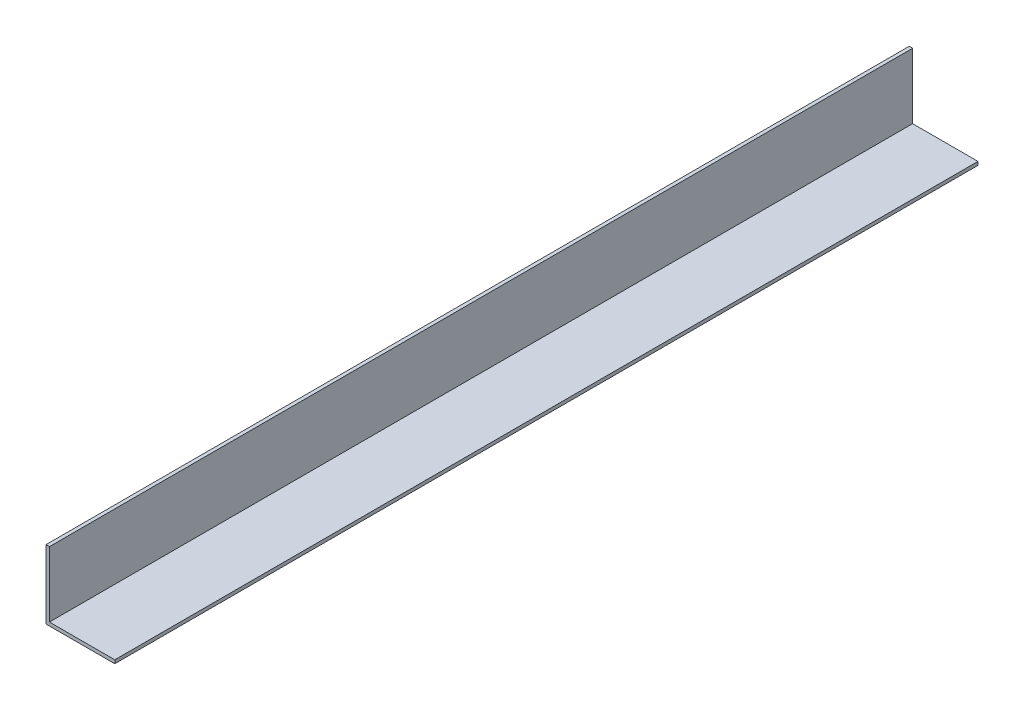
ISO-10303-21;
HEADER;
FILE_DESCRIPTION(('STEP AP214'),'2;1');
FILE_NAME('part.step','',(''),(''),'','','');
FILE_SCHEMA(('AUTOMOTIVE_DESIGN { 1 0 10303 214 1 1 1 1 }'));
ENDSEC;
DATA;
#1=APPLICATION_CONTEXT('core data for automotive mechanical design processes');
#2=APPLICATION_PROTOCOL_DEFINITION('international standard','automotive_design',2000,#1);
#3=PRODUCT_CONTEXT('',#1,'mechanical');
#4=PRODUCT('Part','Part','',(#3));
#5=PRODUCT_RELATED_PRODUCT_CATEGORY('part','',(#4));
#6=PRODUCT_DEFINITION_FORMATION('','',#4);
#7=PRODUCT_DEFINITION_CONTEXT('part definition',#1,'design');
#8=PRODUCT_DEFINITION('design','',#6,#7);
#9=PRODUCT_DEFINITION_SHAPE('','',#8);
#10=(LENGTH_UNIT() NAMED_UNIT(*) SI_UNIT(.MILLI.,.METRE.));
#11=(NAMED_UNIT(*) PLANE_ANGLE_UNIT() SI_UNIT($,.RADIAN.));
#12=(NAMED_UNIT(*) SI_UNIT($,.STERADIAN.) SOLID_ANGLE_UNIT());
#13=UNCERTAINTY_MEASURE_WITH_UNIT(LENGTH_MEASURE(1.E-05),#10,'distance_accuracy_value','');
#14=(GEOMETRIC_REPRESENTATION_CONTEXT(3) GLOBAL_UNCERTAINTY_ASSIGNED_CONTEXT((#13)) GLOBAL_UNIT_ASSIGNED_CONTEXT((#10,
#11,#12)) REPRESENTATION_CONTEXT('',''));
#15=CARTESIAN_POINT('',(0.,0.,0.));
#16=DIRECTION('',(0.,0.,1.));
#17=DIRECTION('',(1.,0.,0.));
#18=AXIS2_PLACEMENT_3D('',#15,#16,#17);
#19=CARTESIAN_POINT('',(20.,0.,251.));
#20=DIRECTION('',(0.,1.,0.));
#21=DIRECTION('',(-1.,0.,0.));
#22=AXIS2_PLACEMENT_3D('',#19,#20,#21);
#23=PLANE('',#22);
#24=DIRECTION('',(1.,0.,0.));
#25=VECTOR('',#24,1.);
#26=CARTESIAN_POINT('',(20.,0.,0.));
#27=LINE('',#26,#25);
#28=CARTESIAN_POINT('',(0.,0.,0.));
#29=VERTEX_POINT('',#28);
#30=CARTESIAN_POINT('',(20.,0.,0.));
#31=VERTEX_POINT('',#30);
#32=EDGE_CURVE('E121',#29,#31,#27,.T.);
#33=ORIENTED_EDGE('',*,*,#32,.T.);
#34=DIRECTION('',(0.,0.,-1.));
#35=VECTOR('',#34,1.);
#36=CARTESIAN_POINT('',(20.,0.,251.));
#37=LINE('',#36,#35);
#38=CARTESIAN_POINT('',(20.,0.,251.));
#39=VERTEX_POINT('',#38);
#40=EDGE_CURVE('E11',#39,#31,#37,.T.);
#41=ORIENTED_EDGE('',*,*,#40,.F.);
#42=DIRECTION('',(1.,0.,0.));
#43=VECTOR('',#42,1.);
#44=CARTESIAN_POINT('',(20.,0.,251.));
#45=LINE('',#44,#43);
#46=CARTESIAN_POINT('',(0.,0.,251.));
#47=VERTEX_POINT('',#46);
#48=EDGE_CURVE('E131',#47,#39,#45,.T.);
#49=ORIENTED_EDGE('',*,*,#48,.F.);
#50=DIRECTION('',(0.,0.,-1.));
#51=VECTOR('',#50,1.);
#52=CARTESIAN_POINT('',(0.,0.,251.));
#53=LINE('',#52,#51);
#54=EDGE_CURVE('E117',#47,#29,#53,.T.);
#55=ORIENTED_EDGE('',*,*,#54,.T.);
#56=EDGE_LOOP('',(#33,#41,#49,#55));
#57=FACE_BOUND('',#56,.T.);
#58=ADVANCED_FACE('F37',(#57),#23,.F.);
#59=CARTESIAN_POINT('',(20.,1.,251.));
#60=DIRECTION('',(-1.,0.,0.));
#61=DIRECTION('',(0.,0.,1.));
#62=AXIS2_PLACEMENT_3D('',#59,#60,#61);
#63=PLANE('',#62);
#64=DIRECTION('',(0.,1.,0.));
#65=VECTOR('',#64,1.);
#66=CARTESIAN_POINT('',(20.,1.,0.));
#67=LINE('',#66,#65);
#68=CARTESIAN_POINT('',(20.,1.,0.));
#69=VERTEX_POINT('',#68);
#70=EDGE_CURVE('E124',#31,#69,#67,.T.);
#71=ORIENTED_EDGE('',*,*,#70,.T.);
#72=DIRECTION('',(0.,0.,-1.));
#73=VECTOR('',#72,1.);
#74=CARTESIAN_POINT('',(20.,1.,251.));
#75=LINE('',#74,#73);
#76=CARTESIAN_POINT('',(20.,1.,251.));
#77=VERTEX_POINT('',#76);
#78=EDGE_CURVE('E45',#77,#69,#75,.T.);
#79=ORIENTED_EDGE('',*,*,#78,.F.);
#80=DIRECTION('',(0.,1.,0.));
#81=VECTOR('',#80,1.);
#82=CARTESIAN_POINT('',(20.,1.,251.));
#83=LINE('',#82,#81);
#84=EDGE_CURVE('E90',#39,#77,#83,.T.);
#85=ORIENTED_EDGE('',*,*,#84,.F.);
#86=ORIENTED_EDGE('',*,*,#40,.T.);
#87=EDGE_LOOP('',(#71,#79,#85,#86));
#88=FACE_BOUND('',#87,.T.);
#89=ADVANCED_FACE('F155',(#88),#63,.F.);
#90=CARTESIAN_POINT('',(1.,1.,251.));
#91=DIRECTION('',(0.,-1.,0.));
#92=DIRECTION('',(0.,0.,-1.));
#93=AXIS2_PLACEMENT_3D('',#90,#91,#92);
#94=PLANE('',#93);
#95=DIRECTION('',(-1.,0.,0.));
#96=VECTOR('',#95,1.);
#97=CARTESIAN_POINT('',(1.,1.,0.));
#98=LINE('',#97,#96);
#99=CARTESIAN_POINT('',(1.,1.,0.));
#100=VERTEX_POINT('',#99);
#101=EDGE_CURVE('E126',#69,#100,#98,.T.);
#102=ORIENTED_EDGE('',*,*,#101,.T.);
#103=DIRECTION('',(0.,0.,-1.));
#104=VECTOR('',#103,1.);
#105=CARTESIAN_POINT('',(1.,1.,251.));
#106=LINE('',#105,#104);
#107=CARTESIAN_POINT('',(1.,1.,251.));
#108=VERTEX_POINT('',#107);
#109=EDGE_CURVE('E112',#108,#100,#106,.T.);
#110=ORIENTED_EDGE('',*,*,#109,.F.);
#111=DIRECTION('',(-1.,0.,0.));
#112=VECTOR('',#111,1.);
#113=CARTESIAN_POINT('',(1.,1.,251.));
#114=LINE('',#113,#112);
#115=EDGE_CURVE('E103',#77,#108,#114,.T.);
#116=ORIENTED_EDGE('',*,*,#115,.F.);
#117=ORIENTED_EDGE('',*,*,#78,.T.);
#118=EDGE_LOOP('',(#102,#110,#116,#117));
#119=FACE_BOUND('',#118,.T.);
#120=ADVANCED_FACE('F137',(#119),#94,.F.);
#121=CARTESIAN_POINT('',(1.,20.,251.));
#122=DIRECTION('',(-1.,0.,0.));
#123=DIRECTION('',(0.,-1.,0.));
#124=AXIS2_PLACEMENT_3D('',#121,#122,#123);
#125=PLANE('',#124);
#126=DIRECTION('',(0.,1.,0.));
#127=VECTOR('',#126,1.);
#128=CARTESIAN_POINT('',(1.,20.,0.));
#129=LINE('',#128,#127);
#130=CARTESIAN_POINT('',(1.,20.,0.));
#131=VERTEX_POINT('',#130);
#132=EDGE_CURVE('E111',#100,#131,#129,.T.);
#133=ORIENTED_EDGE('',*,*,#132,.T.);
#134=DIRECTION('',(0.,0.,-1.));
#135=VECTOR('',#134,1.);
#136=CARTESIAN_POINT('',(1.,20.,251.));
#137=LINE('',#136,#135);
#138=CARTESIAN_POINT('',(1.,20.,251.));
#139=VERTEX_POINT('',#138);
#140=EDGE_CURVE('E108',#139,#131,#137,.T.);
#141=ORIENTED_EDGE('',*,*,#140,.F.);
#142=DIRECTION('',(0.,1.,0.));
#143=VECTOR('',#142,1.);
#144=CARTESIAN_POINT('',(1.,20.,251.));
#145=LINE('',#144,#143);
#146=EDGE_CURVE('E97',#108,#139,#145,.T.);
#147=ORIENTED_EDGE('',*,*,#146,.F.);
#148=ORIENTED_EDGE('',*,*,#109,.T.);
#149=EDGE_LOOP('',(#133,#141,#147,#148));
#150=FACE_BOUND('',#149,.T.);
#151=ADVANCED_FACE('F109',(#150),#125,.F.);
#152=CARTESIAN_POINT('',(0.,20.,251.));
#153=DIRECTION('',(0.,-1.,0.));
#154=DIRECTION('',(0.,0.,-1.));
#155=AXIS2_PLACEMENT_3D('',#152,#153,#154);
#156=PLANE('',#155);
#157=DIRECTION('',(-1.,0.,0.));
#158=VECTOR('',#157,1.);
#159=CARTESIAN_POINT('',(0.,20.,0.));
#160=LINE('',#159,#158);
#161=CARTESIAN_POINT('',(0.,20.,0.));
#162=VERTEX_POINT('',#161);
#163=EDGE_CURVE('E76',#131,#162,#160,.T.);
#164=ORIENTED_EDGE('',*,*,#163,.T.);
#165=DIRECTION('',(0.,0.,-1.));
#166=VECTOR('',#165,1.);
#167=CARTESIAN_POINT('',(0.,20.,251.));
#168=LINE('',#167,#166);
#169=CARTESIAN_POINT('',(0.,20.,251.));
#170=VERTEX_POINT('',#169);
#171=EDGE_CURVE('E113',#170,#162,#168,.T.);
#172=ORIENTED_EDGE('',*,*,#171,.F.);
#173=DIRECTION('',(-1.,0.,0.));
#174=VECTOR('',#173,1.);
#175=CARTESIAN_POINT('',(0.,20.,251.));
#176=LINE('',#175,#174);
#177=EDGE_CURVE('E101',#139,#170,#176,.T.);
#178=ORIENTED_EDGE('',*,*,#177,.F.);
#179=ORIENTED_EDGE('',*,*,#140,.T.);
#180=EDGE_LOOP('',(#164,#172,#178,#179));
#181=FACE_BOUND('',#180,.T.);
#182=ADVANCED_FACE('F115',(#181),#156,.F.);
#183=CARTESIAN_POINT('',(0.,0.,251.));
#184=DIRECTION('',(1.,0.,0.));
#185=DIRECTION('',(0.,0.,-1.));
#186=AXIS2_PLACEMENT_3D('',#183,#184,#185);
#187=PLANE('',#186);
#188=DIRECTION('',(0.,-1.,0.));
#189=VECTOR('',#188,1.);
#190=CARTESIAN_POINT('',(0.,0.,0.));
#191=LINE('',#190,#189);
#192=EDGE_CURVE('E82',#162,#29,#191,.T.);
#193=ORIENTED_EDGE('',*,*,#192,.T.);
#194=ORIENTED_EDGE('',*,*,#54,.F.);
#195=DIRECTION('',(0.,-1.,0.));
#196=VECTOR('',#195,1.);
#197=CARTESIAN_POINT('',(0.,0.,251.));
#198=LINE('',#197,#196);
#199=EDGE_CURVE('E53',#170,#47,#198,.T.);
#200=ORIENTED_EDGE('',*,*,#199,.F.);
#201=ORIENTED_EDGE('',*,*,#171,.T.);
#202=EDGE_LOOP('',(#193,#194,#200,#201));
#203=FACE_BOUND('',#202,.T.);
#204=ADVANCED_FACE('F144',(#203),#187,.F.);
#205=CARTESIAN_POINT('',(0.,0.,251.));
#206=DIRECTION('',(0.,0.,-1.));
#207=DIRECTION('',(-1.,0.,0.));
#208=AXIS2_PLACEMENT_3D('',#205,#206,#207);
#209=PLANE('',#208);
#210=ORIENTED_EDGE('',*,*,#48,.T.);
#211=ORIENTED_EDGE('',*,*,#84,.T.);
#212=ORIENTED_EDGE('',*,*,#115,.T.);
#213=ORIENTED_EDGE('',*,*,#146,.T.);
#214=ORIENTED_EDGE('',*,*,#177,.T.);
#215=ORIENTED_EDGE('',*,*,#199,.T.);
#216=EDGE_LOOP('',(#210,#211,#212,#213,#214,#215));
#217=FACE_BOUND('',#216,.T.);
#218=ADVANCED_FACE('F99',(#217),#209,.F.);
#219=CARTESIAN_POINT('',(0.,0.,0.));
#220=DIRECTION('',(0.,0.,-1.));
#221=DIRECTION('',(-1.,0.,0.));
#222=AXIS2_PLACEMENT_3D('',#219,#220,#221);
#223=PLANE('',#222);
#224=ORIENTED_EDGE('',*,*,#32,.F.);
#225=ORIENTED_EDGE('',*,*,#192,.F.);
#226=ORIENTED_EDGE('',*,*,#163,.F.);
#227=ORIENTED_EDGE('',*,*,#132,.F.);
#228=ORIENTED_EDGE('',*,*,#101,.F.);
#229=ORIENTED_EDGE('',*,*,#70,.F.);
#230=EDGE_LOOP('',(#224,#225,#226,#227,#228,#229));
#231=FACE_BOUND('',#230,.T.);
#232=ADVANCED_FACE('F140',(#231),#223,.T.);
#233=CLOSED_SHELL('',(#58,#89,#120,#151,#182,#204,#218,#232));
#234=MANIFOLD_SOLID_BREP('B2',#233);
#235=ADVANCED_BREP_SHAPE_REPRESENTATION('',(#18,#234),#14);
#236=SHAPE_DEFINITION_REPRESENTATION(#9,#235);
ENDSEC;
END-ISO-10303-21;
